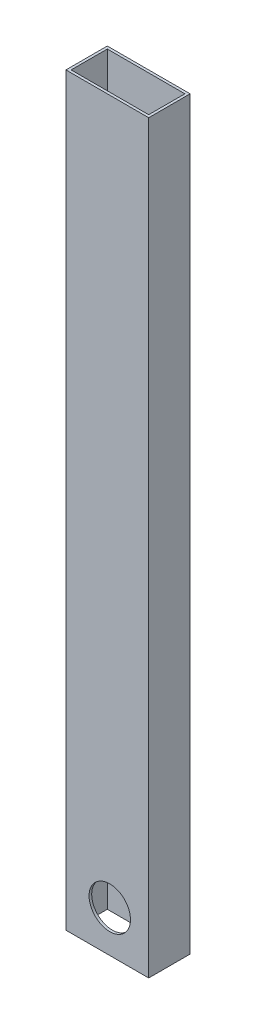
ISO-10303-21;
HEADER;
FILE_DESCRIPTION(('STEP AP214'),'2;1');
FILE_NAME('part.step','',(''),(''),'','','');
FILE_SCHEMA(('AUTOMOTIVE_DESIGN { 1 0 10303 214 1 1 1 1 }'));
ENDSEC;
DATA;
#1=APPLICATION_CONTEXT('core data for automotive mechanical design processes');
#2=APPLICATION_PROTOCOL_DEFINITION('international standard','automotive_design',2000,#1);
#3=PRODUCT_CONTEXT('',#1,'mechanical');
#4=PRODUCT('Part','Part','',(#3));
#5=PRODUCT_RELATED_PRODUCT_CATEGORY('part','',(#4));
#6=PRODUCT_DEFINITION_FORMATION('','',#4);
#7=PRODUCT_DEFINITION_CONTEXT('part definition',#1,'design');
#8=PRODUCT_DEFINITION('design','',#6,#7);
#9=PRODUCT_DEFINITION_SHAPE('','',#8);
#10=(LENGTH_UNIT() NAMED_UNIT(*) SI_UNIT(.MILLI.,.METRE.));
#11=(NAMED_UNIT(*) PLANE_ANGLE_UNIT() SI_UNIT($,.RADIAN.));
#12=(NAMED_UNIT(*) SI_UNIT($,.STERADIAN.) SOLID_ANGLE_UNIT());
#13=UNCERTAINTY_MEASURE_WITH_UNIT(LENGTH_MEASURE(1.E-05),#10,'distance_accuracy_value','');
#14=(GEOMETRIC_REPRESENTATION_CONTEXT(3) GLOBAL_UNCERTAINTY_ASSIGNED_CONTEXT((#13)) GLOBAL_UNIT_ASSIGNED_CONTEXT((#10,
#11,#12)) REPRESENTATION_CONTEXT('',''));
#15=CARTESIAN_POINT('',(0.,0.,0.));
#16=DIRECTION('',(0.,0.,1.));
#17=DIRECTION('',(1.,0.,0.));
#18=AXIS2_PLACEMENT_3D('',#15,#16,#17);
#19=CARTESIAN_POINT('',(0.,457.2,0.));
#20=DIRECTION('',(0.,1.,0.));
#21=DIRECTION('',(0.,0.,1.));
#22=AXIS2_PLACEMENT_3D('',#19,#20,#21);
#23=PLANE('',#22);
#24=DIRECTION('',(0.,0.,1.));
#25=VECTOR('',#24,1.);
#26=CARTESIAN_POINT('',(-25.4000000000001,457.2,12.7));
#27=LINE('',#26,#25);
#28=CARTESIAN_POINT('',(-25.4000000000001,457.2,-12.7));
#29=VERTEX_POINT('',#28);
#30=CARTESIAN_POINT('',(-25.4000000000001,457.2,12.7));
#31=VERTEX_POINT('',#30);
#32=EDGE_CURVE('E137',#29,#31,#27,.T.);
#33=ORIENTED_EDGE('',*,*,#32,.T.);
#34=DIRECTION('',(1.,0.,0.));
#35=VECTOR('',#34,1.);
#36=CARTESIAN_POINT('',(25.3999999999999,457.2,12.7));
#37=LINE('',#36,#35);
#38=CARTESIAN_POINT('',(25.3999999999999,457.2,12.7));
#39=VERTEX_POINT('',#38);
#40=EDGE_CURVE('E140',#31,#39,#37,.T.);
#41=ORIENTED_EDGE('',*,*,#40,.T.);
#42=DIRECTION('',(0.,0.,-1.));
#43=VECTOR('',#42,1.);
#44=CARTESIAN_POINT('',(25.3999999999999,457.2,12.7));
#45=LINE('',#44,#43);
#46=CARTESIAN_POINT('',(25.3999999999999,457.2,-12.7));
#47=VERTEX_POINT('',#46);
#48=EDGE_CURVE('E143',#39,#47,#45,.T.);
#49=ORIENTED_EDGE('',*,*,#48,.T.);
#50=DIRECTION('',(-1.,0.,0.));
#51=VECTOR('',#50,1.);
#52=CARTESIAN_POINT('',(25.3999999999999,457.2,-12.7));
#53=LINE('',#52,#51);
#54=EDGE_CURVE('E145',#47,#29,#53,.T.);
#55=ORIENTED_EDGE('',*,*,#54,.T.);
#56=EDGE_LOOP('',(#33,#41,#49,#55));
#57=FACE_BOUND('',#56,.T.);
#58=DIRECTION('',(1.,0.,0.));
#59=VECTOR('',#58,1.);
#60=CARTESIAN_POINT('',(23.8124999999999,457.2,11.1125));
#61=LINE('',#60,#59);
#62=CARTESIAN_POINT('',(-23.8125000000001,457.2,11.1125));
#63=VERTEX_POINT('',#62);
#64=CARTESIAN_POINT('',(23.8124999999999,457.2,11.1125));
#65=VERTEX_POINT('',#64);
#66=EDGE_CURVE('E107',#63,#65,#61,.T.);
#67=ORIENTED_EDGE('',*,*,#66,.F.);
#68=DIRECTION('',(0.,0.,1.));
#69=VECTOR('',#68,1.);
#70=CARTESIAN_POINT('',(-23.8125000000001,457.2,11.1125));
#71=LINE('',#70,#69);
#72=CARTESIAN_POINT('',(-23.8125000000001,457.2,-11.1125));
#73=VERTEX_POINT('',#72);
#74=EDGE_CURVE('E99',#73,#63,#71,.T.);
#75=ORIENTED_EDGE('',*,*,#74,.F.);
#76=DIRECTION('',(-1.,0.,0.));
#77=VECTOR('',#76,1.);
#78=CARTESIAN_POINT('',(23.8124999999999,457.2,-11.1125));
#79=LINE('',#78,#77);
#80=CARTESIAN_POINT('',(23.8124999999999,457.2,-11.1125));
#81=VERTEX_POINT('',#80);
#82=EDGE_CURVE('E121',#81,#73,#79,.T.);
#83=ORIENTED_EDGE('',*,*,#82,.F.);
#84=DIRECTION('',(0.,0.,-1.));
#85=VECTOR('',#84,1.);
#86=CARTESIAN_POINT('',(23.8124999999999,457.2,11.1125));
#87=LINE('',#86,#85);
#88=EDGE_CURVE('E119',#65,#81,#87,.T.);
#89=ORIENTED_EDGE('',*,*,#88,.F.);
#90=EDGE_LOOP('',(#67,#75,#83,#89));
#91=FACE_BOUND('',#90,.T.);
#92=ADVANCED_FACE('F33',(#57,#91),#23,.T.);
#93=CARTESIAN_POINT('',(0.,0.,0.));
#94=DIRECTION('',(0.,1.,0.));
#95=DIRECTION('',(0.,0.,1.));
#96=AXIS2_PLACEMENT_3D('',#93,#94,#95);
#97=PLANE('',#96);
#98=DIRECTION('',(0.,0.,1.));
#99=VECTOR('',#98,1.);
#100=CARTESIAN_POINT('',(-25.4000000000001,0.,12.7));
#101=LINE('',#100,#99);
#102=CARTESIAN_POINT('',(-25.4000000000001,0.,-12.7));
#103=VERTEX_POINT('',#102);
#104=CARTESIAN_POINT('',(-25.4000000000001,0.,12.7));
#105=VERTEX_POINT('',#104);
#106=EDGE_CURVE('E115',#103,#105,#101,.T.);
#107=ORIENTED_EDGE('',*,*,#106,.F.);
#108=DIRECTION('',(-1.,0.,0.));
#109=VECTOR('',#108,1.);
#110=CARTESIAN_POINT('',(25.3999999999999,0.,-12.7));
#111=LINE('',#110,#109);
#112=CARTESIAN_POINT('',(25.3999999999999,0.,-12.7));
#113=VERTEX_POINT('',#112);
#114=EDGE_CURVE('E141',#113,#103,#111,.T.);
#115=ORIENTED_EDGE('',*,*,#114,.F.);
#116=DIRECTION('',(0.,0.,-1.));
#117=VECTOR('',#116,1.);
#118=CARTESIAN_POINT('',(25.3999999999999,0.,12.7));
#119=LINE('',#118,#117);
#120=CARTESIAN_POINT('',(25.3999999999999,0.,12.7));
#121=VERTEX_POINT('',#120);
#122=EDGE_CURVE('E152',#121,#113,#119,.T.);
#123=ORIENTED_EDGE('',*,*,#122,.F.);
#124=DIRECTION('',(1.,0.,0.));
#125=VECTOR('',#124,1.);
#126=CARTESIAN_POINT('',(25.3999999999999,0.,12.7));
#127=LINE('',#126,#125);
#128=EDGE_CURVE('E150',#105,#121,#127,.T.);
#129=ORIENTED_EDGE('',*,*,#128,.F.);
#130=EDGE_LOOP('',(#107,#115,#123,#129));
#131=FACE_BOUND('',#130,.T.);
#132=DIRECTION('',(0.,0.,1.));
#133=VECTOR('',#132,1.);
#134=CARTESIAN_POINT('',(-23.8125000000001,0.,11.1125));
#135=LINE('',#134,#133);
#136=CARTESIAN_POINT('',(-23.8125000000001,0.,-11.1125));
#137=VERTEX_POINT('',#136);
#138=CARTESIAN_POINT('',(-23.8125000000001,0.,11.1125));
#139=VERTEX_POINT('',#138);
#140=EDGE_CURVE('E57',#137,#139,#135,.T.);
#141=ORIENTED_EDGE('',*,*,#140,.T.);
#142=DIRECTION('',(1.,0.,0.));
#143=VECTOR('',#142,1.);
#144=CARTESIAN_POINT('',(23.8124999999999,0.,11.1125));
#145=LINE('',#144,#143);
#146=CARTESIAN_POINT('',(23.8124999999999,0.,11.1125));
#147=VERTEX_POINT('',#146);
#148=EDGE_CURVE('E114',#139,#147,#145,.T.);
#149=ORIENTED_EDGE('',*,*,#148,.T.);
#150=DIRECTION('',(0.,0.,-1.));
#151=VECTOR('',#150,1.);
#152=CARTESIAN_POINT('',(23.8124999999999,0.,11.1125));
#153=LINE('',#152,#151);
#154=CARTESIAN_POINT('',(23.8124999999999,0.,-11.1125));
#155=VERTEX_POINT('',#154);
#156=EDGE_CURVE('E129',#147,#155,#153,.T.);
#157=ORIENTED_EDGE('',*,*,#156,.T.);
#158=DIRECTION('',(-1.,0.,0.));
#159=VECTOR('',#158,1.);
#160=CARTESIAN_POINT('',(23.8124999999999,0.,-11.1125));
#161=LINE('',#160,#159);
#162=EDGE_CURVE('E108',#155,#137,#161,.T.);
#163=ORIENTED_EDGE('',*,*,#162,.T.);
#164=EDGE_LOOP('',(#141,#149,#157,#163));
#165=FACE_BOUND('',#164,.T.);
#166=ADVANCED_FACE('F171',(#131,#165),#97,.F.);
#167=CARTESIAN_POINT('',(-25.4000000000001,457.2,12.7));
#168=DIRECTION('',(1.,0.,0.));
#169=DIRECTION('',(0.,0.,-1.));
#170=AXIS2_PLACEMENT_3D('',#167,#168,#169);
#171=PLANE('',#170);
#172=ORIENTED_EDGE('',*,*,#106,.T.);
#173=DIRECTION('',(0.,-1.,0.));
#174=VECTOR('',#173,1.);
#175=CARTESIAN_POINT('',(-25.4000000000001,457.2,12.7));
#176=LINE('',#175,#174);
#177=EDGE_CURVE('E11',#31,#105,#176,.T.);
#178=ORIENTED_EDGE('',*,*,#177,.F.);
#179=ORIENTED_EDGE('',*,*,#32,.F.);
#180=DIRECTION('',(0.,-1.,0.));
#181=VECTOR('',#180,1.);
#182=CARTESIAN_POINT('',(-25.4000000000001,457.2,-12.7));
#183=LINE('',#182,#181);
#184=EDGE_CURVE('E147',#29,#103,#183,.T.);
#185=ORIENTED_EDGE('',*,*,#184,.T.);
#186=EDGE_LOOP('',(#172,#178,#179,#185));
#187=FACE_BOUND('',#186,.T.);
#188=ADVANCED_FACE('F35',(#187),#171,.F.);
#189=CARTESIAN_POINT('',(25.3999999999999,457.2,12.7));
#190=DIRECTION('',(0.,0.,-1.));
#191=DIRECTION('',(-1.,0.,0.));
#192=AXIS2_PLACEMENT_3D('',#189,#190,#191);
#193=PLANE('',#192);
#194=CARTESIAN_POINT('',(1.52399999999995,25.4,12.7));
#195=DIRECTION('',(0.,0.,-1.));
#196=DIRECTION('',(-1.,0.,0.));
#197=AXIS2_PLACEMENT_3D('',#194,#195,#196);
#198=CIRCLE('',#197,12.7);
#199=CARTESIAN_POINT('',(-11.176,25.4,12.7));
#200=VERTEX_POINT('',#199);
#201=EDGE_CURVE('E127',#200,#200,#198,.T.);
#202=ORIENTED_EDGE('',*,*,#201,.T.);
#203=EDGE_LOOP('',(#202));
#204=FACE_BOUND('',#203,.T.);
#205=ORIENTED_EDGE('',*,*,#128,.T.);
#206=DIRECTION('',(0.,-1.,0.));
#207=VECTOR('',#206,1.);
#208=CARTESIAN_POINT('',(25.3999999999999,457.2,12.7));
#209=LINE('',#208,#207);
#210=EDGE_CURVE('E42',#39,#121,#209,.T.);
#211=ORIENTED_EDGE('',*,*,#210,.F.);
#212=ORIENTED_EDGE('',*,*,#40,.F.);
#213=ORIENTED_EDGE('',*,*,#177,.T.);
#214=EDGE_LOOP('',(#205,#211,#212,#213));
#215=FACE_BOUND('',#214,.T.);
#216=ADVANCED_FACE('F181',(#204,#215),#193,.F.);
#217=CARTESIAN_POINT('',(25.3999999999999,457.2,12.7));
#218=DIRECTION('',(-1.,0.,0.));
#219=DIRECTION('',(0.,0.,1.));
#220=AXIS2_PLACEMENT_3D('',#217,#218,#219);
#221=PLANE('',#220);
#222=ORIENTED_EDGE('',*,*,#122,.T.);
#223=DIRECTION('',(0.,-1.,0.));
#224=VECTOR('',#223,1.);
#225=CARTESIAN_POINT('',(25.3999999999999,457.2,-12.7));
#226=LINE('',#225,#224);
#227=EDGE_CURVE('E157',#47,#113,#226,.T.);
#228=ORIENTED_EDGE('',*,*,#227,.F.);
#229=ORIENTED_EDGE('',*,*,#48,.F.);
#230=ORIENTED_EDGE('',*,*,#210,.T.);
#231=EDGE_LOOP('',(#222,#228,#229,#230));
#232=FACE_BOUND('',#231,.T.);
#233=ADVANCED_FACE('F165',(#232),#221,.F.);
#234=CARTESIAN_POINT('',(25.3999999999999,457.2,-12.7));
#235=DIRECTION('',(0.,0.,1.));
#236=DIRECTION('',(1.,0.,0.));
#237=AXIS2_PLACEMENT_3D('',#234,#235,#236);
#238=PLANE('',#237);
#239=CARTESIAN_POINT('',(1.52399999999995,25.4,-12.7));
#240=DIRECTION('',(0.,0.,-1.));
#241=DIRECTION('',(-1.,0.,0.));
#242=AXIS2_PLACEMENT_3D('',#239,#240,#241);
#243=CIRCLE('',#242,12.7);
#244=CARTESIAN_POINT('',(-11.176,25.4,-12.7));
#245=VERTEX_POINT('',#244);
#246=EDGE_CURVE('E206',#245,#245,#243,.T.);
#247=ORIENTED_EDGE('',*,*,#246,.F.);
#248=EDGE_LOOP('',(#247));
#249=FACE_BOUND('',#248,.T.);
#250=ORIENTED_EDGE('',*,*,#114,.T.);
#251=ORIENTED_EDGE('',*,*,#184,.F.);
#252=ORIENTED_EDGE('',*,*,#54,.F.);
#253=ORIENTED_EDGE('',*,*,#227,.T.);
#254=EDGE_LOOP('',(#250,#251,#252,#253));
#255=FACE_BOUND('',#254,.T.);
#256=ADVANCED_FACE('F175',(#249,#255),#238,.F.);
#257=CARTESIAN_POINT('',(-23.8125000000001,457.2,11.1125));
#258=DIRECTION('',(1.,0.,0.));
#259=DIRECTION('',(0.,0.,-1.));
#260=AXIS2_PLACEMENT_3D('',#257,#258,#259);
#261=PLANE('',#260);
#262=ORIENTED_EDGE('',*,*,#140,.F.);
#263=DIRECTION('',(0.,-1.,0.));
#264=VECTOR('',#263,1.);
#265=CARTESIAN_POINT('',(-23.8125000000001,457.2,-11.1125));
#266=LINE('',#265,#264);
#267=EDGE_CURVE('E103',#73,#137,#266,.T.);
#268=ORIENTED_EDGE('',*,*,#267,.F.);
#269=ORIENTED_EDGE('',*,*,#74,.T.);
#270=DIRECTION('',(0.,-1.,0.));
#271=VECTOR('',#270,1.);
#272=CARTESIAN_POINT('',(-23.8125000000001,457.2,11.1125));
#273=LINE('',#272,#271);
#274=EDGE_CURVE('E102',#63,#139,#273,.T.);
#275=ORIENTED_EDGE('',*,*,#274,.T.);
#276=EDGE_LOOP('',(#262,#268,#269,#275));
#277=FACE_BOUND('',#276,.T.);
#278=ADVANCED_FACE('F101',(#277),#261,.T.);
#279=CARTESIAN_POINT('',(23.8124999999999,457.2,11.1125));
#280=DIRECTION('',(0.,0.,-1.));
#281=DIRECTION('',(-1.,0.,0.));
#282=AXIS2_PLACEMENT_3D('',#279,#280,#281);
#283=PLANE('',#282);
#284=CARTESIAN_POINT('',(1.52399999999995,25.4,11.1125));
#285=DIRECTION('',(0.,0.,-1.));
#286=DIRECTION('',(-1.,0.,0.));
#287=AXIS2_PLACEMENT_3D('',#284,#285,#286);
#288=CIRCLE('',#287,12.7);
#289=CARTESIAN_POINT('',(-11.176,25.4,11.1125));
#290=VERTEX_POINT('',#289);
#291=EDGE_CURVE('E210',#290,#290,#288,.T.);
#292=ORIENTED_EDGE('',*,*,#291,.F.);
#293=EDGE_LOOP('',(#292));
#294=FACE_BOUND('',#293,.T.);
#295=ORIENTED_EDGE('',*,*,#148,.F.);
#296=ORIENTED_EDGE('',*,*,#274,.F.);
#297=ORIENTED_EDGE('',*,*,#66,.T.);
#298=DIRECTION('',(0.,-1.,0.));
#299=VECTOR('',#298,1.);
#300=CARTESIAN_POINT('',(23.8124999999999,457.2,11.1125));
#301=LINE('',#300,#299);
#302=EDGE_CURVE('E116',#65,#147,#301,.T.);
#303=ORIENTED_EDGE('',*,*,#302,.T.);
#304=EDGE_LOOP('',(#295,#296,#297,#303));
#305=FACE_BOUND('',#304,.T.);
#306=ADVANCED_FACE('F111',(#294,#305),#283,.T.);
#307=CARTESIAN_POINT('',(23.8124999999999,457.2,11.1125));
#308=DIRECTION('',(-1.,0.,0.));
#309=DIRECTION('',(0.,0.,1.));
#310=AXIS2_PLACEMENT_3D('',#307,#308,#309);
#311=PLANE('',#310);
#312=ORIENTED_EDGE('',*,*,#156,.F.);
#313=ORIENTED_EDGE('',*,*,#302,.F.);
#314=ORIENTED_EDGE('',*,*,#88,.T.);
#315=DIRECTION('',(0.,-1.,0.));
#316=VECTOR('',#315,1.);
#317=CARTESIAN_POINT('',(23.8124999999999,457.2,-11.1125));
#318=LINE('',#317,#316);
#319=EDGE_CURVE('E49',#81,#155,#318,.T.);
#320=ORIENTED_EDGE('',*,*,#319,.T.);
#321=EDGE_LOOP('',(#312,#313,#314,#320));
#322=FACE_BOUND('',#321,.T.);
#323=ADVANCED_FACE('F228',(#322),#311,.T.);
#324=CARTESIAN_POINT('',(23.8124999999999,457.2,-11.1125));
#325=DIRECTION('',(0.,0.,1.));
#326=DIRECTION('',(1.,0.,0.));
#327=AXIS2_PLACEMENT_3D('',#324,#325,#326);
#328=PLANE('',#327);
#329=CARTESIAN_POINT('',(1.52399999999995,25.4,-11.1125));
#330=DIRECTION('',(0.,0.,1.));
#331=DIRECTION('',(1.,0.,0.));
#332=AXIS2_PLACEMENT_3D('',#329,#330,#331);
#333=CIRCLE('',#332,12.7);
#334=CARTESIAN_POINT('',(14.2239999999999,25.4,-11.1125));
#335=VERTEX_POINT('',#334);
#336=EDGE_CURVE('E37',#335,#335,#333,.T.);
#337=ORIENTED_EDGE('',*,*,#336,.F.);
#338=EDGE_LOOP('',(#337));
#339=FACE_BOUND('',#338,.T.);
#340=ORIENTED_EDGE('',*,*,#162,.F.);
#341=ORIENTED_EDGE('',*,*,#319,.F.);
#342=ORIENTED_EDGE('',*,*,#82,.T.);
#343=ORIENTED_EDGE('',*,*,#267,.T.);
#344=EDGE_LOOP('',(#340,#341,#342,#343));
#345=FACE_BOUND('',#344,.T.);
#346=ADVANCED_FACE('F223',(#339,#345),#328,.T.);
#347=CARTESIAN_POINT('',(1.52399999999995,25.4,444.5));
#348=DIRECTION('',(0.,0.,-1.));
#349=DIRECTION('',(-1.,0.,0.));
#350=AXIS2_PLACEMENT_3D('',#347,#348,#349);
#351=CYLINDRICAL_SURFACE('',#350,12.7);
#352=ORIENTED_EDGE('',*,*,#336,.T.);
#353=EDGE_LOOP('',(#352));
#354=FACE_BOUND('',#353,.T.);
#355=ORIENTED_EDGE('',*,*,#246,.T.);
#356=EDGE_LOOP('',(#355));
#357=FACE_BOUND('',#356,.T.);
#358=ADVANCED_FACE('F217',(#354,#357),#351,.F.);
#359=ORIENTED_EDGE('',*,*,#291,.T.);
#360=EDGE_LOOP('',(#359));
#361=FACE_BOUND('',#360,.T.);
#362=ORIENTED_EDGE('',*,*,#201,.F.);
#363=EDGE_LOOP('',(#362));
#364=FACE_BOUND('',#363,.T.);
#365=ADVANCED_FACE('F215',(#361,#364),#351,.F.);
#366=CLOSED_SHELL('',(#92,#166,#188,#216,#233,#256,#278,#306,#323,#346,#358,#365));
#367=MANIFOLD_SOLID_BREP('B2',#366);
#368=ADVANCED_BREP_SHAPE_REPRESENTATION('',(#18,#367),#14);
#369=SHAPE_DEFINITION_REPRESENTATION(#9,#368);
ENDSEC;
END-ISO-10303-21;
